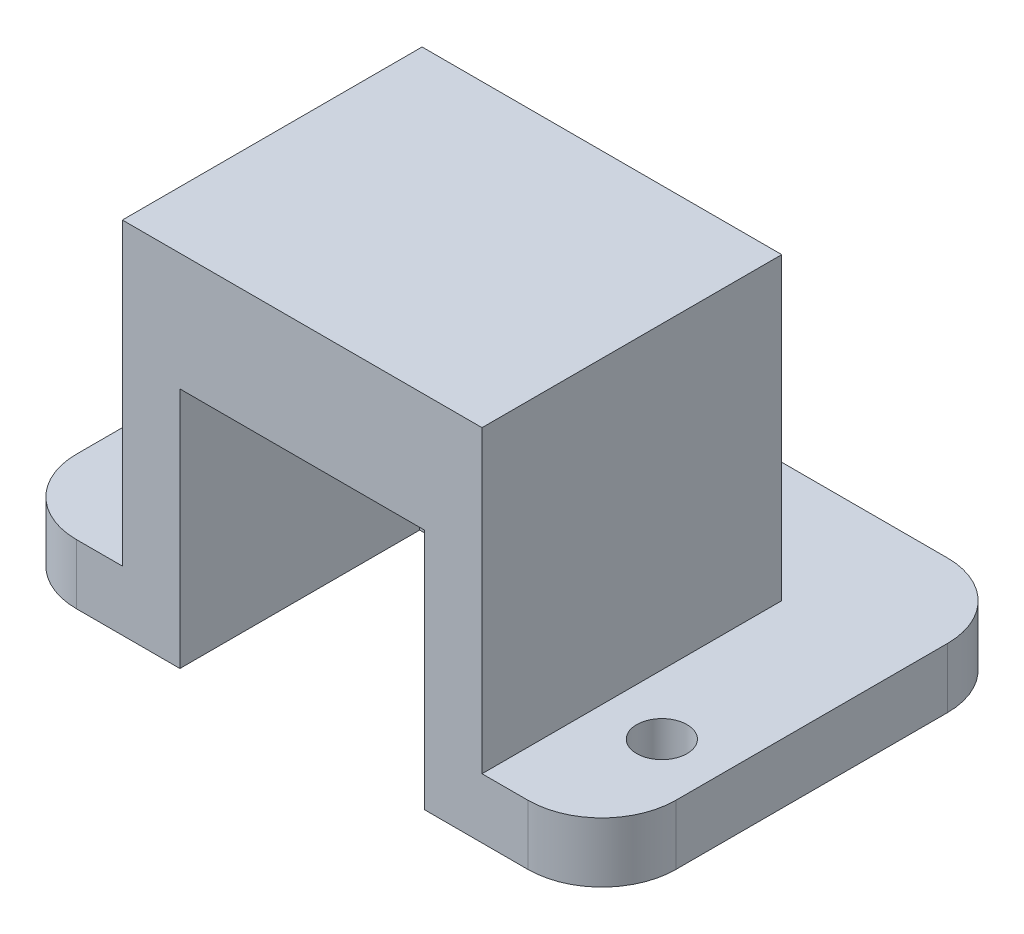
ISO-10303-21;
HEADER;
FILE_DESCRIPTION(('STEP AP214'),'2;1');
FILE_NAME('part.step','',(''),(''),'','','');
FILE_SCHEMA(('AUTOMOTIVE_DESIGN { 1 0 10303 214 1 1 1 1 }'));
ENDSEC;
DATA;
#1=APPLICATION_CONTEXT('core data for automotive mechanical design processes');
#2=APPLICATION_PROTOCOL_DEFINITION('international standard','automotive_design',2000,#1);
#3=PRODUCT_CONTEXT('',#1,'mechanical');
#4=PRODUCT('Part','Part','',(#3));
#5=PRODUCT_RELATED_PRODUCT_CATEGORY('part','',(#4));
#6=PRODUCT_DEFINITION_FORMATION('','',#4);
#7=PRODUCT_DEFINITION_CONTEXT('part definition',#1,'design');
#8=PRODUCT_DEFINITION('design','',#6,#7);
#9=PRODUCT_DEFINITION_SHAPE('','',#8);
#10=(LENGTH_UNIT() NAMED_UNIT(*) SI_UNIT(.MILLI.,.METRE.));
#11=(NAMED_UNIT(*) PLANE_ANGLE_UNIT() SI_UNIT($,.RADIAN.));
#12=(NAMED_UNIT(*) SI_UNIT($,.STERADIAN.) SOLID_ANGLE_UNIT());
#13=UNCERTAINTY_MEASURE_WITH_UNIT(LENGTH_MEASURE(1.E-05),#10,'distance_accuracy_value','');
#14=(GEOMETRIC_REPRESENTATION_CONTEXT(3) GLOBAL_UNCERTAINTY_ASSIGNED_CONTEXT((#13)) GLOBAL_UNIT_ASSIGNED_CONTEXT((#10,
#11,#12)) REPRESENTATION_CONTEXT('',''));
#15=CARTESIAN_POINT('',(0.,0.,0.));
#16=DIRECTION('',(0.,0.,1.));
#17=DIRECTION('',(1.,0.,0.));
#18=AXIS2_PLACEMENT_3D('',#15,#16,#17);
#19=CARTESIAN_POINT('',(-18.83,0.,-3.83));
#20=DIRECTION('',(0.,-1.,0.));
#21=DIRECTION('',(0.,0.,-1.));
#22=AXIS2_PLACEMENT_3D('',#19,#20,#21);
#23=CYLINDRICAL_SURFACE('',#22,6.17);
#24=DIRECTION('',(0.,-1.,0.));
#25=VECTOR('',#24,1.);
#26=CARTESIAN_POINT('',(-25.,0.,-3.83));
#27=LINE('',#26,#25);
#28=CARTESIAN_POINT('',(-25.,-9.99999999999999,-3.83));
#29=VERTEX_POINT('',#28);
#30=CARTESIAN_POINT('',(-25.,-15.,-3.83));
#31=VERTEX_POINT('',#30);
#32=EDGE_CURVE('E329',#29,#31,#27,.T.);
#33=ORIENTED_EDGE('',*,*,#32,.F.);
#34=CARTESIAN_POINT('',(-18.83,-9.99999999999999,-3.83));
#35=DIRECTION('',(0.,-1.,0.));
#36=DIRECTION('',(0.,0.,-1.));
#37=AXIS2_PLACEMENT_3D('',#34,#35,#36);
#38=CIRCLE('',#37,6.17);
#39=CARTESIAN_POINT('',(-18.83,-9.99999999999999,-10.));
#40=VERTEX_POINT('',#39);
#41=EDGE_CURVE('E49',#40,#29,#38,.F.);
#42=ORIENTED_EDGE('',*,*,#41,.F.);
#43=DIRECTION('',(0.,-1.,0.));
#44=VECTOR('',#43,1.);
#45=CARTESIAN_POINT('',(-18.83,0.,-10.));
#46=LINE('',#45,#44);
#47=CARTESIAN_POINT('',(-18.83,-15.,-10.));
#48=VERTEX_POINT('',#47);
#49=EDGE_CURVE('E333',#48,#40,#46,.F.);
#50=ORIENTED_EDGE('',*,*,#49,.F.);
#51=CARTESIAN_POINT('',(-18.83,-15.,-3.83));
#52=DIRECTION('',(0.,1.,0.));
#53=DIRECTION('',(0.,0.,1.));
#54=AXIS2_PLACEMENT_3D('',#51,#52,#53);
#55=CIRCLE('',#54,6.17);
#56=EDGE_CURVE('E11',#31,#48,#55,.F.);
#57=ORIENTED_EDGE('',*,*,#56,.F.);
#58=EDGE_LOOP('',(#33,#42,#50,#57));
#59=FACE_BOUND('',#58,.T.);
#60=ADVANCED_FACE('F41',(#59),#23,.T.);
#61=CARTESIAN_POINT('',(-18.83,0.,18.83));
#62=DIRECTION('',(0.,-1.,0.));
#63=DIRECTION('',(0.,0.,-1.));
#64=AXIS2_PLACEMENT_3D('',#61,#62,#63);
#65=CYLINDRICAL_SURFACE('',#64,6.17);
#66=DIRECTION('',(0.,-1.,0.));
#67=VECTOR('',#66,1.);
#68=CARTESIAN_POINT('',(-18.83,0.,25.));
#69=LINE('',#68,#67);
#70=CARTESIAN_POINT('',(-18.83,-9.99999999999999,25.));
#71=VERTEX_POINT('',#70);
#72=CARTESIAN_POINT('',(-18.83,-15.,25.));
#73=VERTEX_POINT('',#72);
#74=EDGE_CURVE('E314',#71,#73,#69,.T.);
#75=ORIENTED_EDGE('',*,*,#74,.F.);
#76=CARTESIAN_POINT('',(-18.83,-9.99999999999999,18.83));
#77=DIRECTION('',(0.,-1.,0.));
#78=DIRECTION('',(0.,0.,-1.));
#79=AXIS2_PLACEMENT_3D('',#76,#77,#78);
#80=CIRCLE('',#79,6.17);
#81=CARTESIAN_POINT('',(-25.,-9.99999999999999,18.83));
#82=VERTEX_POINT('',#81);
#83=EDGE_CURVE('E322',#82,#71,#80,.F.);
#84=ORIENTED_EDGE('',*,*,#83,.F.);
#85=DIRECTION('',(0.,-1.,0.));
#86=VECTOR('',#85,1.);
#87=CARTESIAN_POINT('',(-25.,0.,18.83));
#88=LINE('',#87,#86);
#89=CARTESIAN_POINT('',(-25.,-15.,18.83));
#90=VERTEX_POINT('',#89);
#91=EDGE_CURVE('E318',#90,#82,#88,.F.);
#92=ORIENTED_EDGE('',*,*,#91,.F.);
#93=CARTESIAN_POINT('',(-18.83,-15.,18.83));
#94=DIRECTION('',(0.,1.,0.));
#95=DIRECTION('',(0.,0.,1.));
#96=AXIS2_PLACEMENT_3D('',#93,#94,#95);
#97=CIRCLE('',#96,6.17);
#98=EDGE_CURVE('E325',#73,#90,#97,.F.);
#99=ORIENTED_EDGE('',*,*,#98,.F.);
#100=EDGE_LOOP('',(#75,#84,#92,#99));
#101=FACE_BOUND('',#100,.T.);
#102=ADVANCED_FACE('F341',(#101),#65,.T.);
#103=CARTESIAN_POINT('',(18.83,0.,-3.83));
#104=DIRECTION('',(0.,1.,0.));
#105=DIRECTION('',(0.,0.,1.));
#106=AXIS2_PLACEMENT_3D('',#103,#104,#105);
#107=CYLINDRICAL_SURFACE('',#106,6.17);
#108=DIRECTION('',(0.,1.,0.));
#109=VECTOR('',#108,1.);
#110=CARTESIAN_POINT('',(25.,0.,-3.83));
#111=LINE('',#110,#109);
#112=CARTESIAN_POINT('',(25.,-15.,-3.83));
#113=VERTEX_POINT('',#112);
#114=CARTESIAN_POINT('',(25.,-9.99999999999999,-3.83));
#115=VERTEX_POINT('',#114);
#116=EDGE_CURVE('E299',#113,#115,#111,.T.);
#117=ORIENTED_EDGE('',*,*,#116,.F.);
#118=CARTESIAN_POINT('',(18.83,-15.,-3.83));
#119=DIRECTION('',(0.,1.,0.));
#120=DIRECTION('',(0.,0.,1.));
#121=AXIS2_PLACEMENT_3D('',#118,#119,#120);
#122=CIRCLE('',#121,6.17);
#123=CARTESIAN_POINT('',(18.83,-15.,-10.));
#124=VERTEX_POINT('',#123);
#125=EDGE_CURVE('E307',#124,#113,#122,.F.);
#126=ORIENTED_EDGE('',*,*,#125,.F.);
#127=DIRECTION('',(0.,1.,0.));
#128=VECTOR('',#127,1.);
#129=CARTESIAN_POINT('',(18.83,0.,-10.));
#130=LINE('',#129,#128);
#131=CARTESIAN_POINT('',(18.83,-9.99999999999999,-10.));
#132=VERTEX_POINT('',#131);
#133=EDGE_CURVE('E303',#132,#124,#130,.F.);
#134=ORIENTED_EDGE('',*,*,#133,.F.);
#135=CARTESIAN_POINT('',(18.83,-9.99999999999999,-3.83));
#136=DIRECTION('',(0.,-1.,0.));
#137=DIRECTION('',(0.,0.,-1.));
#138=AXIS2_PLACEMENT_3D('',#135,#136,#137);
#139=CIRCLE('',#138,6.17);
#140=EDGE_CURVE('E310',#115,#132,#139,.F.);
#141=ORIENTED_EDGE('',*,*,#140,.F.);
#142=EDGE_LOOP('',(#117,#126,#134,#141));
#143=FACE_BOUND('',#142,.T.);
#144=ADVANCED_FACE('F369',(#143),#107,.T.);
#145=CARTESIAN_POINT('',(18.83,0.,18.83));
#146=DIRECTION('',(0.,-1.,0.));
#147=DIRECTION('',(0.,0.,-1.));
#148=AXIS2_PLACEMENT_3D('',#145,#146,#147);
#149=CYLINDRICAL_SURFACE('',#148,6.17);
#150=DIRECTION('',(0.,-1.,0.));
#151=VECTOR('',#150,1.);
#152=CARTESIAN_POINT('',(25.,0.,18.83));
#153=LINE('',#152,#151);
#154=CARTESIAN_POINT('',(25.,-9.99999999999999,18.83));
#155=VERTEX_POINT('',#154);
#156=CARTESIAN_POINT('',(25.,-15.,18.83));
#157=VERTEX_POINT('',#156);
#158=EDGE_CURVE('E186',#155,#157,#153,.T.);
#159=ORIENTED_EDGE('',*,*,#158,.F.);
#160=CARTESIAN_POINT('',(18.83,-9.99999999999999,18.83));
#161=DIRECTION('',(0.,-1.,0.));
#162=DIRECTION('',(0.,0.,-1.));
#163=AXIS2_PLACEMENT_3D('',#160,#161,#162);
#164=CIRCLE('',#163,6.17);
#165=CARTESIAN_POINT('',(18.83,-9.99999999999999,25.));
#166=VERTEX_POINT('',#165);
#167=EDGE_CURVE('E293',#166,#155,#164,.F.);
#168=ORIENTED_EDGE('',*,*,#167,.F.);
#169=DIRECTION('',(0.,-1.,0.));
#170=VECTOR('',#169,1.);
#171=CARTESIAN_POINT('',(18.83,0.,25.));
#172=LINE('',#171,#170);
#173=CARTESIAN_POINT('',(18.83,-15.,25.));
#174=VERTEX_POINT('',#173);
#175=EDGE_CURVE('E161',#174,#166,#172,.F.);
#176=ORIENTED_EDGE('',*,*,#175,.F.);
#177=CARTESIAN_POINT('',(18.83,-15.,18.83));
#178=DIRECTION('',(0.,1.,0.));
#179=DIRECTION('',(0.,0.,1.));
#180=AXIS2_PLACEMENT_3D('',#177,#178,#179);
#181=CIRCLE('',#180,6.17);
#182=EDGE_CURVE('E296',#157,#174,#181,.F.);
#183=ORIENTED_EDGE('',*,*,#182,.F.);
#184=EDGE_LOOP('',(#159,#168,#176,#183));
#185=FACE_BOUND('',#184,.T.);
#186=ADVANCED_FACE('F361',(#185),#149,.T.);
#187=CARTESIAN_POINT('',(-15.,15.,5.));
#188=DIRECTION('',(1.,0.,0.));
#189=DIRECTION('',(0.,1.,0.));
#190=AXIS2_PLACEMENT_3D('',#187,#188,#189);
#191=PLANE('',#190);
#192=DIRECTION('',(0.,0.,-1.));
#193=VECTOR('',#192,1.);
#194=CARTESIAN_POINT('',(-15.,-9.99999999999999,-10.));
#195=LINE('',#194,#193);
#196=CARTESIAN_POINT('',(-15.,-9.99999999999999,25.));
#197=VERTEX_POINT('',#196);
#198=CARTESIAN_POINT('',(-15.,-9.99999999999999,0.));
#199=VERTEX_POINT('',#198);
#200=EDGE_CURVE('E166',#197,#199,#195,.T.);
#201=ORIENTED_EDGE('',*,*,#200,.F.);
#202=DIRECTION('',(0.,-1.,0.));
#203=VECTOR('',#202,1.);
#204=CARTESIAN_POINT('',(-15.,-15.,25.));
#205=LINE('',#204,#203);
#206=CARTESIAN_POINT('',(-15.,15.,25.));
#207=VERTEX_POINT('',#206);
#208=EDGE_CURVE('E212',#207,#197,#205,.T.);
#209=ORIENTED_EDGE('',*,*,#208,.F.);
#210=DIRECTION('',(0.,0.,-1.));
#211=VECTOR('',#210,1.);
#212=CARTESIAN_POINT('',(-15.,15.,5.));
#213=LINE('',#212,#211);
#214=CARTESIAN_POINT('',(-15.,15.,0.));
#215=VERTEX_POINT('',#214);
#216=EDGE_CURVE('E194',#207,#215,#213,.T.);
#217=ORIENTED_EDGE('',*,*,#216,.T.);
#218=DIRECTION('',(0.,-1.,0.));
#219=VECTOR('',#218,1.);
#220=CARTESIAN_POINT('',(-15.,15.,0.));
#221=LINE('',#220,#219);
#222=EDGE_CURVE('E273',#215,#199,#221,.T.);
#223=ORIENTED_EDGE('',*,*,#222,.T.);
#224=EDGE_LOOP('',(#201,#209,#217,#223));
#225=FACE_BOUND('',#224,.T.);
#226=ADVANCED_FACE('F345',(#225),#191,.F.);
#227=CARTESIAN_POINT('',(0.,0.,0.));
#228=DIRECTION('',(0.,0.,1.));
#229=DIRECTION('',(1.,0.,0.));
#230=AXIS2_PLACEMENT_3D('',#227,#228,#229);
#231=PLANE('',#230);
#232=DIRECTION('',(1.,0.,0.));
#233=VECTOR('',#232,1.);
#234=CARTESIAN_POINT('',(15.,-9.99999999999999,0.));
#235=LINE('',#234,#233);
#236=CARTESIAN_POINT('',(15.,-9.99999999999999,0.));
#237=VERTEX_POINT('',#236);
#238=EDGE_CURVE('E184',#199,#237,#235,.T.);
#239=ORIENTED_EDGE('',*,*,#238,.F.);
#240=ORIENTED_EDGE('',*,*,#222,.F.);
#241=DIRECTION('',(1.,0.,0.));
#242=VECTOR('',#241,1.);
#243=CARTESIAN_POINT('',(-15.,15.,0.));
#244=LINE('',#243,#242);
#245=CARTESIAN_POINT('',(15.,15.,0.));
#246=VERTEX_POINT('',#245);
#247=EDGE_CURVE('E279',#215,#246,#244,.T.);
#248=ORIENTED_EDGE('',*,*,#247,.T.);
#249=DIRECTION('',(0.,-1.,0.));
#250=VECTOR('',#249,1.);
#251=CARTESIAN_POINT('',(15.,15.,0.));
#252=LINE('',#251,#250);
#253=EDGE_CURVE('E283',#246,#237,#252,.T.);
#254=ORIENTED_EDGE('',*,*,#253,.T.);
#255=EDGE_LOOP('',(#239,#240,#248,#254));
#256=FACE_BOUND('',#255,.T.);
#257=ADVANCED_FACE('F351',(#256),#231,.F.);
#258=CARTESIAN_POINT('',(-15.,-15.,5.));
#259=DIRECTION('',(0.,1.,0.));
#260=DIRECTION('',(0.,0.,1.));
#261=AXIS2_PLACEMENT_3D('',#258,#259,#260);
#262=PLANE('',#261);
#263=CARTESIAN_POINT('',(-20.,-15.,15.));
#264=DIRECTION('',(0.,1.,0.));
#265=DIRECTION('',(0.,0.,1.));
#266=AXIS2_PLACEMENT_3D('',#263,#264,#265);
#267=CIRCLE('',#266,2.1);
#268=CARTESIAN_POINT('',(-20.,-15.,17.1));
#269=VERTEX_POINT('',#268);
#270=EDGE_CURVE('E435',#269,#269,#267,.T.);
#271=ORIENTED_EDGE('',*,*,#270,.T.);
#272=EDGE_LOOP('',(#271));
#273=FACE_BOUND('',#272,.T.);
#274=CARTESIAN_POINT('',(20.,-15.,15.));
#275=DIRECTION('',(0.,1.,0.));
#276=DIRECTION('',(0.,0.,1.));
#277=AXIS2_PLACEMENT_3D('',#274,#275,#276);
#278=CIRCLE('',#277,2.1);
#279=CARTESIAN_POINT('',(20.,-15.,17.1));
#280=VERTEX_POINT('',#279);
#281=EDGE_CURVE('E438',#280,#280,#278,.T.);
#282=ORIENTED_EDGE('',*,*,#281,.T.);
#283=EDGE_LOOP('',(#282));
#284=FACE_BOUND('',#283,.T.);
#285=CARTESIAN_POINT('',(0.,-15.,-5.));
#286=DIRECTION('',(0.,1.,0.));
#287=DIRECTION('',(0.,0.,1.));
#288=AXIS2_PLACEMENT_3D('',#285,#286,#287);
#289=CIRCLE('',#288,2.1);
#290=CARTESIAN_POINT('',(0.,-15.,-2.9));
#291=VERTEX_POINT('',#290);
#292=EDGE_CURVE('E260',#291,#291,#289,.T.);
#293=ORIENTED_EDGE('',*,*,#292,.T.);
#294=EDGE_LOOP('',(#293));
#295=FACE_BOUND('',#294,.T.);
#296=DIRECTION('',(0.,0.,1.));
#297=VECTOR('',#296,1.);
#298=CARTESIAN_POINT('',(-25.,-15.,-10.));
#299=LINE('',#298,#297);
#300=EDGE_CURVE('E199',#31,#90,#299,.T.);
#301=ORIENTED_EDGE('',*,*,#300,.F.);
#302=ORIENTED_EDGE('',*,*,#56,.T.);
#303=DIRECTION('',(-1.,0.,0.));
#304=VECTOR('',#303,1.);
#305=CARTESIAN_POINT('',(15.,-15.,-10.));
#306=LINE('',#305,#304);
#307=EDGE_CURVE('E267',#124,#48,#306,.T.);
#308=ORIENTED_EDGE('',*,*,#307,.F.);
#309=ORIENTED_EDGE('',*,*,#125,.T.);
#310=DIRECTION('',(0.,0.,-1.));
#311=VECTOR('',#310,1.);
#312=CARTESIAN_POINT('',(25.,-15.,25.));
#313=LINE('',#312,#311);
#314=EDGE_CURVE('E437',#157,#113,#313,.T.);
#315=ORIENTED_EDGE('',*,*,#314,.F.);
#316=ORIENTED_EDGE('',*,*,#182,.T.);
#317=DIRECTION('',(1.,0.,0.));
#318=VECTOR('',#317,1.);
#319=CARTESIAN_POINT('',(10.2,-15.,25.));
#320=LINE('',#319,#318);
#321=CARTESIAN_POINT('',(10.2,-15.,25.));
#322=VERTEX_POINT('',#321);
#323=EDGE_CURVE('E178',#322,#174,#320,.T.);
#324=ORIENTED_EDGE('',*,*,#323,.F.);
#325=DIRECTION('',(0.,0.,-1.));
#326=VECTOR('',#325,1.);
#327=CARTESIAN_POINT('',(10.2,-15.,25.));
#328=LINE('',#327,#326);
#329=CARTESIAN_POINT('',(10.2,-15.,5.));
#330=VERTEX_POINT('',#329);
#331=EDGE_CURVE('E233',#322,#330,#328,.T.);
#332=ORIENTED_EDGE('',*,*,#331,.T.);
#333=DIRECTION('',(1.,0.,0.));
#334=VECTOR('',#333,1.);
#335=CARTESIAN_POINT('',(-15.,-15.,5.));
#336=LINE('',#335,#334);
#337=CARTESIAN_POINT('',(-10.2,-15.,5.));
#338=VERTEX_POINT('',#337);
#339=EDGE_CURVE('E276',#338,#330,#336,.T.);
#340=ORIENTED_EDGE('',*,*,#339,.F.);
#341=DIRECTION('',(0.,0.,-1.));
#342=VECTOR('',#341,1.);
#343=CARTESIAN_POINT('',(-10.2,-15.,25.));
#344=LINE('',#343,#342);
#345=CARTESIAN_POINT('',(-10.2,-15.,25.));
#346=VERTEX_POINT('',#345);
#347=EDGE_CURVE('E255',#346,#338,#344,.T.);
#348=ORIENTED_EDGE('',*,*,#347,.F.);
#349=DIRECTION('',(1.,0.,0.));
#350=VECTOR('',#349,1.);
#351=CARTESIAN_POINT('',(-15.,-15.,25.));
#352=LINE('',#351,#350);
#353=EDGE_CURVE('E216',#73,#346,#352,.T.);
#354=ORIENTED_EDGE('',*,*,#353,.F.);
#355=ORIENTED_EDGE('',*,*,#98,.T.);
#356=EDGE_LOOP('',(#301,#302,#308,#309,#315,#316,#324,#332,#340,#348,#354,#355));
#357=FACE_BOUND('',#356,.T.);
#358=ADVANCED_FACE('F353',(#273,#284,#295,#357),#262,.F.);
#359=CARTESIAN_POINT('',(15.,15.,5.));
#360=DIRECTION('',(1.,0.,0.));
#361=DIRECTION('',(0.,1.,0.));
#362=AXIS2_PLACEMENT_3D('',#359,#360,#361);
#363=PLANE('',#362);
#364=DIRECTION('',(0.,0.,1.));
#365=VECTOR('',#364,1.);
#366=CARTESIAN_POINT('',(15.,-9.99999999999999,25.));
#367=LINE('',#366,#365);
#368=CARTESIAN_POINT('',(15.,-9.99999999999999,25.));
#369=VERTEX_POINT('',#368);
#370=EDGE_CURVE('E172',#237,#369,#367,.T.);
#371=ORIENTED_EDGE('',*,*,#370,.F.);
#372=ORIENTED_EDGE('',*,*,#253,.F.);
#373=DIRECTION('',(0.,0.,-1.));
#374=VECTOR('',#373,1.);
#375=CARTESIAN_POINT('',(15.,15.,5.));
#376=LINE('',#375,#374);
#377=CARTESIAN_POINT('',(15.,15.,25.));
#378=VERTEX_POINT('',#377);
#379=EDGE_CURVE('E174',#378,#246,#376,.T.);
#380=ORIENTED_EDGE('',*,*,#379,.F.);
#381=DIRECTION('',(0.,1.,0.));
#382=VECTOR('',#381,1.);
#383=CARTESIAN_POINT('',(15.,-15.,25.));
#384=LINE('',#383,#382);
#385=EDGE_CURVE('E157',#369,#378,#384,.T.);
#386=ORIENTED_EDGE('',*,*,#385,.F.);
#387=EDGE_LOOP('',(#371,#372,#380,#386));
#388=FACE_BOUND('',#387,.T.);
#389=ADVANCED_FACE('F170',(#388),#363,.T.);
#390=CARTESIAN_POINT('',(-15.,15.,5.));
#391=DIRECTION('',(0.,1.,0.));
#392=DIRECTION('',(0.,0.,1.));
#393=AXIS2_PLACEMENT_3D('',#390,#391,#392);
#394=PLANE('',#393);
#395=ORIENTED_EDGE('',*,*,#247,.F.);
#396=ORIENTED_EDGE('',*,*,#216,.F.);
#397=DIRECTION('',(-1.,0.,0.));
#398=VECTOR('',#397,1.);
#399=CARTESIAN_POINT('',(-15.,15.,25.));
#400=LINE('',#399,#398);
#401=EDGE_CURVE('E177',#378,#207,#400,.T.);
#402=ORIENTED_EDGE('',*,*,#401,.F.);
#403=ORIENTED_EDGE('',*,*,#379,.T.);
#404=EDGE_LOOP('',(#395,#396,#402,#403));
#405=FACE_BOUND('',#404,.T.);
#406=ADVANCED_FACE('F349',(#405),#394,.T.);
#407=CARTESIAN_POINT('',(0.,0.,5.));
#408=DIRECTION('',(0.,0.,1.));
#409=DIRECTION('',(1.,0.,0.));
#410=AXIS2_PLACEMENT_3D('',#407,#408,#409);
#411=PLANE('',#410);
#412=DIRECTION('',(0.,-1.,0.));
#413=VECTOR('',#412,1.);
#414=CARTESIAN_POINT('',(10.2,-15.,5.));
#415=LINE('',#414,#413);
#416=CARTESIAN_POINT('',(10.2,5.2,5.));
#417=VERTEX_POINT('',#416);
#418=EDGE_CURVE('E217',#417,#330,#415,.T.);
#419=ORIENTED_EDGE('',*,*,#418,.F.);
#420=DIRECTION('',(1.,0.,0.));
#421=VECTOR('',#420,1.);
#422=CARTESIAN_POINT('',(-10.2,5.2,5.));
#423=LINE('',#422,#421);
#424=CARTESIAN_POINT('',(-10.2,5.2,5.));
#425=VERTEX_POINT('',#424);
#426=EDGE_CURVE('E237',#425,#417,#423,.T.);
#427=ORIENTED_EDGE('',*,*,#426,.F.);
#428=DIRECTION('',(0.,1.,0.));
#429=VECTOR('',#428,1.);
#430=CARTESIAN_POINT('',(-10.2,-15.,5.));
#431=LINE('',#430,#429);
#432=EDGE_CURVE('E211',#338,#425,#431,.T.);
#433=ORIENTED_EDGE('',*,*,#432,.F.);
#434=ORIENTED_EDGE('',*,*,#339,.T.);
#435=EDGE_LOOP('',(#419,#427,#433,#434));
#436=FACE_BOUND('',#435,.T.);
#437=ADVANCED_FACE('F381',(#436),#411,.T.);
#438=CARTESIAN_POINT('',(15.,-9.99999999999999,-10.));
#439=DIRECTION('',(0.,-1.,0.));
#440=DIRECTION('',(0.,0.,-1.));
#441=AXIS2_PLACEMENT_3D('',#438,#439,#440);
#442=PLANE('',#441);
#443=CARTESIAN_POINT('',(-20.,-9.99999999999999,15.));
#444=DIRECTION('',(0.,1.,0.));
#445=DIRECTION('',(0.,0.,1.));
#446=AXIS2_PLACEMENT_3D('',#443,#444,#445);
#447=CIRCLE('',#446,2.1);
#448=CARTESIAN_POINT('',(-20.,-9.99999999999999,17.1));
#449=VERTEX_POINT('',#448);
#450=EDGE_CURVE('E432',#449,#449,#447,.T.);
#451=ORIENTED_EDGE('',*,*,#450,.F.);
#452=EDGE_LOOP('',(#451));
#453=FACE_BOUND('',#452,.T.);
#454=CARTESIAN_POINT('',(20.,-9.99999999999999,15.));
#455=DIRECTION('',(0.,1.,0.));
#456=DIRECTION('',(0.,0.,1.));
#457=AXIS2_PLACEMENT_3D('',#454,#455,#456);
#458=CIRCLE('',#457,2.1);
#459=CARTESIAN_POINT('',(20.,-9.99999999999999,17.1));
#460=VERTEX_POINT('',#459);
#461=EDGE_CURVE('E446',#460,#460,#458,.T.);
#462=ORIENTED_EDGE('',*,*,#461,.F.);
#463=EDGE_LOOP('',(#462));
#464=FACE_BOUND('',#463,.T.);
#465=CARTESIAN_POINT('',(0.,-9.99999999999999,-5.));
#466=DIRECTION('',(0.,1.,0.));
#467=DIRECTION('',(0.,0.,1.));
#468=AXIS2_PLACEMENT_3D('',#465,#466,#467);
#469=CIRCLE('',#468,2.1);
#470=CARTESIAN_POINT('',(0.,-9.99999999999999,-2.9));
#471=VERTEX_POINT('',#470);
#472=EDGE_CURVE('E259',#471,#471,#469,.T.);
#473=ORIENTED_EDGE('',*,*,#472,.F.);
#474=EDGE_LOOP('',(#473));
#475=FACE_BOUND('',#474,.T.);
#476=DIRECTION('',(1.,0.,0.));
#477=VECTOR('',#476,1.);
#478=CARTESIAN_POINT('',(15.,-9.99999999999999,-10.));
#479=LINE('',#478,#477);
#480=EDGE_CURVE('E270',#40,#132,#479,.T.);
#481=ORIENTED_EDGE('',*,*,#480,.F.);
#482=ORIENTED_EDGE('',*,*,#41,.T.);
#483=DIRECTION('',(0.,0.,-1.));
#484=VECTOR('',#483,1.);
#485=CARTESIAN_POINT('',(-25.,-9.99999999999999,-10.));
#486=LINE('',#485,#484);
#487=EDGE_CURVE('E202',#82,#29,#486,.T.);
#488=ORIENTED_EDGE('',*,*,#487,.F.);
#489=ORIENTED_EDGE('',*,*,#83,.T.);
#490=DIRECTION('',(1.,0.,0.));
#491=VECTOR('',#490,1.);
#492=CARTESIAN_POINT('',(-25.,-9.99999999999999,25.));
#493=LINE('',#492,#491);
#494=EDGE_CURVE('E206',#71,#197,#493,.T.);
#495=ORIENTED_EDGE('',*,*,#494,.T.);
#496=ORIENTED_EDGE('',*,*,#200,.T.);
#497=ORIENTED_EDGE('',*,*,#238,.T.);
#498=ORIENTED_EDGE('',*,*,#370,.T.);
#499=DIRECTION('',(-1.,0.,0.));
#500=VECTOR('',#499,1.);
#501=CARTESIAN_POINT('',(25.,-9.99999999999999,25.));
#502=LINE('',#501,#500);
#503=EDGE_CURVE('E152',#166,#369,#502,.T.);
#504=ORIENTED_EDGE('',*,*,#503,.F.);
#505=ORIENTED_EDGE('',*,*,#167,.T.);
#506=DIRECTION('',(0.,0.,1.));
#507=VECTOR('',#506,1.);
#508=CARTESIAN_POINT('',(25.,-9.99999999999999,25.));
#509=LINE('',#508,#507);
#510=EDGE_CURVE('E167',#115,#155,#509,.T.);
#511=ORIENTED_EDGE('',*,*,#510,.F.);
#512=ORIENTED_EDGE('',*,*,#140,.T.);
#513=EDGE_LOOP('',(#481,#482,#488,#489,#495,#496,#497,#498,#504,#505,#511,#512));
#514=FACE_BOUND('',#513,.T.);
#515=ADVANCED_FACE('F182',(#453,#464,#475,#514),#442,.F.);
#516=CARTESIAN_POINT('',(0.,0.,-10.));
#517=DIRECTION('',(0.,0.,1.));
#518=DIRECTION('',(1.,0.,0.));
#519=AXIS2_PLACEMENT_3D('',#516,#517,#518);
#520=PLANE('',#519);
#521=ORIENTED_EDGE('',*,*,#307,.T.);
#522=ORIENTED_EDGE('',*,*,#49,.T.);
#523=ORIENTED_EDGE('',*,*,#480,.T.);
#524=ORIENTED_EDGE('',*,*,#133,.T.);
#525=EDGE_LOOP('',(#521,#522,#523,#524));
#526=FACE_BOUND('',#525,.T.);
#527=ADVANCED_FACE('F389',(#526),#520,.F.);
#528=CARTESIAN_POINT('',(0.,-15.,-5.));
#529=DIRECTION('',(0.,1.,0.));
#530=DIRECTION('',(0.,0.,1.));
#531=AXIS2_PLACEMENT_3D('',#528,#529,#530);
#532=CYLINDRICAL_SURFACE('',#531,2.1);
#533=ORIENTED_EDGE('',*,*,#292,.F.);
#534=EDGE_LOOP('',(#533));
#535=FACE_BOUND('',#534,.T.);
#536=ORIENTED_EDGE('',*,*,#472,.T.);
#537=EDGE_LOOP('',(#536));
#538=FACE_BOUND('',#537,.T.);
#539=ADVANCED_FACE('F395',(#535,#538),#532,.F.);
#540=CARTESIAN_POINT('',(-10.2,-15.,25.));
#541=DIRECTION('',(-1.,0.,0.));
#542=DIRECTION('',(0.,0.,1.));
#543=AXIS2_PLACEMENT_3D('',#540,#541,#542);
#544=PLANE('',#543);
#545=ORIENTED_EDGE('',*,*,#432,.T.);
#546=DIRECTION('',(0.,0.,-1.));
#547=VECTOR('',#546,1.);
#548=CARTESIAN_POINT('',(-10.2,5.2,25.));
#549=LINE('',#548,#547);
#550=CARTESIAN_POINT('',(-10.2,5.2,25.));
#551=VERTEX_POINT('',#550);
#552=EDGE_CURVE('E251',#551,#425,#549,.T.);
#553=ORIENTED_EDGE('',*,*,#552,.F.);
#554=DIRECTION('',(0.,1.,0.));
#555=VECTOR('',#554,1.);
#556=CARTESIAN_POINT('',(-10.2,-15.,25.));
#557=LINE('',#556,#555);
#558=EDGE_CURVE('E220',#346,#551,#557,.T.);
#559=ORIENTED_EDGE('',*,*,#558,.F.);
#560=ORIENTED_EDGE('',*,*,#347,.T.);
#561=EDGE_LOOP('',(#545,#553,#559,#560));
#562=FACE_BOUND('',#561,.T.);
#563=ADVANCED_FACE('F399',(#562),#544,.F.);
#564=CARTESIAN_POINT('',(-10.2,5.2,25.));
#565=DIRECTION('',(0.,1.,0.));
#566=DIRECTION('',(0.,0.,1.));
#567=AXIS2_PLACEMENT_3D('',#564,#565,#566);
#568=PLANE('',#567);
#569=ORIENTED_EDGE('',*,*,#426,.T.);
#570=DIRECTION('',(0.,0.,-1.));
#571=VECTOR('',#570,1.);
#572=CARTESIAN_POINT('',(10.2,5.2,25.));
#573=LINE('',#572,#571);
#574=CARTESIAN_POINT('',(10.2,5.2,25.));
#575=VERTEX_POINT('',#574);
#576=EDGE_CURVE('E247',#575,#417,#573,.T.);
#577=ORIENTED_EDGE('',*,*,#576,.F.);
#578=DIRECTION('',(1.,0.,0.));
#579=VECTOR('',#578,1.);
#580=CARTESIAN_POINT('',(-10.2,5.2,25.));
#581=LINE('',#580,#579);
#582=EDGE_CURVE('E223',#551,#575,#581,.T.);
#583=ORIENTED_EDGE('',*,*,#582,.F.);
#584=ORIENTED_EDGE('',*,*,#552,.T.);
#585=EDGE_LOOP('',(#569,#577,#583,#584));
#586=FACE_BOUND('',#585,.T.);
#587=ADVANCED_FACE('F403',(#586),#568,.F.);
#588=CARTESIAN_POINT('',(10.2,-15.,25.));
#589=DIRECTION('',(1.,0.,0.));
#590=DIRECTION('',(0.,0.,-1.));
#591=AXIS2_PLACEMENT_3D('',#588,#589,#590);
#592=PLANE('',#591);
#593=ORIENTED_EDGE('',*,*,#418,.T.);
#594=ORIENTED_EDGE('',*,*,#331,.F.);
#595=DIRECTION('',(0.,-1.,0.));
#596=VECTOR('',#595,1.);
#597=CARTESIAN_POINT('',(10.2,-15.,25.));
#598=LINE('',#597,#596);
#599=EDGE_CURVE('E226',#575,#322,#598,.T.);
#600=ORIENTED_EDGE('',*,*,#599,.F.);
#601=ORIENTED_EDGE('',*,*,#576,.T.);
#602=EDGE_LOOP('',(#593,#594,#600,#601));
#603=FACE_BOUND('',#602,.T.);
#604=ADVANCED_FACE('F407',(#603),#592,.F.);
#605=CARTESIAN_POINT('',(0.,0.,25.));
#606=DIRECTION('',(0.,0.,-1.));
#607=DIRECTION('',(-1.,0.,0.));
#608=AXIS2_PLACEMENT_3D('',#605,#606,#607);
#609=PLANE('',#608);
#610=ORIENTED_EDGE('',*,*,#494,.F.);
#611=ORIENTED_EDGE('',*,*,#74,.T.);
#612=ORIENTED_EDGE('',*,*,#353,.T.);
#613=ORIENTED_EDGE('',*,*,#558,.T.);
#614=ORIENTED_EDGE('',*,*,#582,.T.);
#615=ORIENTED_EDGE('',*,*,#599,.T.);
#616=ORIENTED_EDGE('',*,*,#323,.T.);
#617=ORIENTED_EDGE('',*,*,#175,.T.);
#618=ORIENTED_EDGE('',*,*,#503,.T.);
#619=ORIENTED_EDGE('',*,*,#385,.T.);
#620=ORIENTED_EDGE('',*,*,#401,.T.);
#621=ORIENTED_EDGE('',*,*,#208,.T.);
#622=EDGE_LOOP('',(#610,#611,#612,#613,#614,#615,#616,#617,#618,#619,#620,#621));
#623=FACE_BOUND('',#622,.T.);
#624=ADVANCED_FACE('F155',(#623),#609,.F.);
#625=CARTESIAN_POINT('',(-25.,0.,0.));
#626=DIRECTION('',(1.,0.,0.));
#627=DIRECTION('',(0.,0.,-1.));
#628=AXIS2_PLACEMENT_3D('',#625,#626,#627);
#629=PLANE('',#628);
#630=ORIENTED_EDGE('',*,*,#487,.T.);
#631=ORIENTED_EDGE('',*,*,#32,.T.);
#632=ORIENTED_EDGE('',*,*,#300,.T.);
#633=ORIENTED_EDGE('',*,*,#91,.T.);
#634=EDGE_LOOP('',(#630,#631,#632,#633));
#635=FACE_BOUND('',#634,.T.);
#636=ADVANCED_FACE('F337',(#635),#629,.F.);
#637=CARTESIAN_POINT('',(25.,0.,0.));
#638=DIRECTION('',(-1.,0.,0.));
#639=DIRECTION('',(0.,0.,1.));
#640=AXIS2_PLACEMENT_3D('',#637,#638,#639);
#641=PLANE('',#640);
#642=ORIENTED_EDGE('',*,*,#314,.T.);
#643=ORIENTED_EDGE('',*,*,#116,.T.);
#644=ORIENTED_EDGE('',*,*,#510,.T.);
#645=ORIENTED_EDGE('',*,*,#158,.T.);
#646=EDGE_LOOP('',(#642,#643,#644,#645));
#647=FACE_BOUND('',#646,.T.);
#648=ADVANCED_FACE('F416',(#647),#641,.F.);
#649=CARTESIAN_POINT('',(20.,-20.,15.));
#650=DIRECTION('',(0.,1.,0.));
#651=DIRECTION('',(0.,0.,1.));
#652=AXIS2_PLACEMENT_3D('',#649,#650,#651);
#653=CYLINDRICAL_SURFACE('',#652,2.1);
#654=ORIENTED_EDGE('',*,*,#461,.T.);
#655=EDGE_LOOP('',(#654));
#656=FACE_BOUND('',#655,.T.);
#657=ORIENTED_EDGE('',*,*,#281,.F.);
#658=EDGE_LOOP('',(#657));
#659=FACE_BOUND('',#658,.T.);
#660=ADVANCED_FACE('F419',(#656,#659),#653,.F.);
#661=CARTESIAN_POINT('',(-20.,-20.,15.));
#662=DIRECTION('',(0.,1.,0.));
#663=DIRECTION('',(0.,0.,1.));
#664=AXIS2_PLACEMENT_3D('',#661,#662,#663);
#665=CYLINDRICAL_SURFACE('',#664,2.1);
#666=ORIENTED_EDGE('',*,*,#450,.T.);
#667=EDGE_LOOP('',(#666));
#668=FACE_BOUND('',#667,.T.);
#669=ORIENTED_EDGE('',*,*,#270,.F.);
#670=EDGE_LOOP('',(#669));
#671=FACE_BOUND('',#670,.T.);
#672=ADVANCED_FACE('F423',(#668,#671),#665,.F.);
#673=CLOSED_SHELL('',(#60,#102,#144,#186,#226,#257,#358,#389,#406,#437,#515,#527,#539,#563,#587,
#604,#624,#636,#648,#660,#672));
#674=MANIFOLD_SOLID_BREP('B2',#673);
#675=ADVANCED_BREP_SHAPE_REPRESENTATION('',(#18,#674),#14);
#676=SHAPE_DEFINITION_REPRESENTATION(#9,#675);
ENDSEC;
END-ISO-10303-21;
